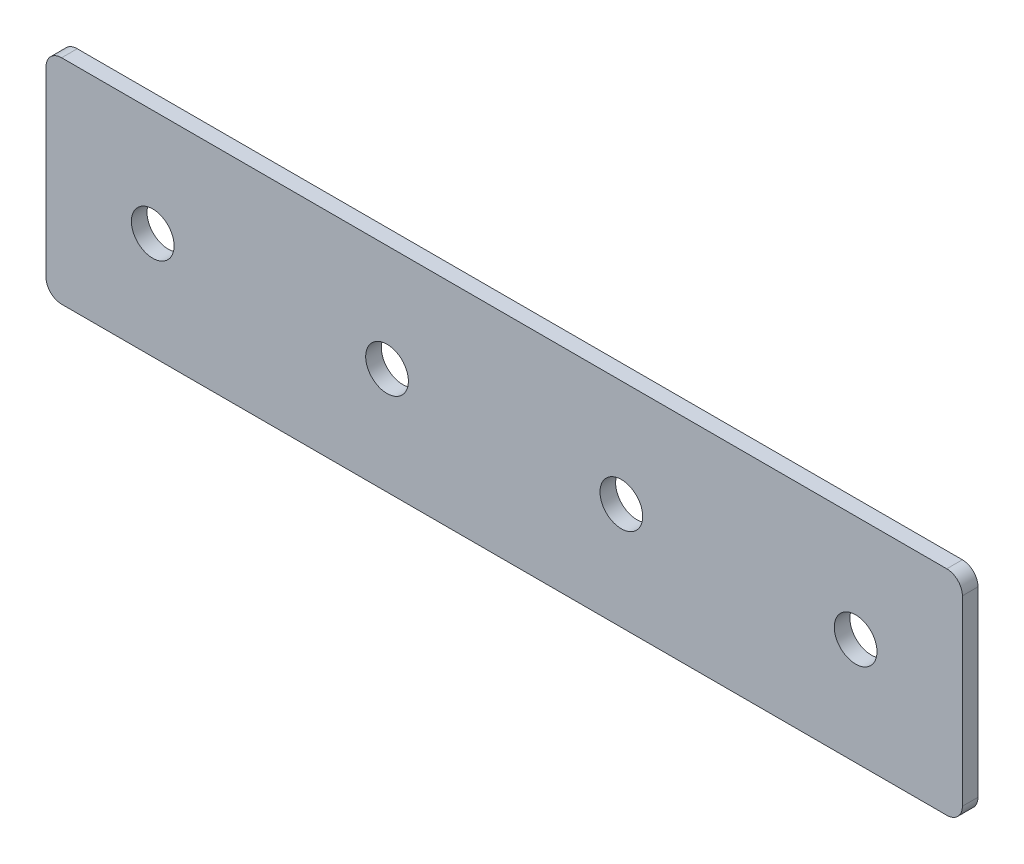
ISO-10303-21;
HEADER;
FILE_DESCRIPTION(('STEP AP214'),'2;1');
FILE_NAME('part.step','',(''),(''),'','','');
FILE_SCHEMA(('AUTOMOTIVE_DESIGN { 1 0 10303 214 1 1 1 1 }'));
ENDSEC;
DATA;
#1=APPLICATION_CONTEXT('core data for automotive mechanical design processes');
#2=APPLICATION_PROTOCOL_DEFINITION('international standard','automotive_design',2000,#1);
#3=PRODUCT_CONTEXT('',#1,'mechanical');
#4=PRODUCT('Part','Part','',(#3));
#5=PRODUCT_RELATED_PRODUCT_CATEGORY('part','',(#4));
#6=PRODUCT_DEFINITION_FORMATION('','',#4);
#7=PRODUCT_DEFINITION_CONTEXT('part definition',#1,'design');
#8=PRODUCT_DEFINITION('design','',#6,#7);
#9=PRODUCT_DEFINITION_SHAPE('','',#8);
#10=(LENGTH_UNIT() NAMED_UNIT(*) SI_UNIT(.MILLI.,.METRE.));
#11=(NAMED_UNIT(*) PLANE_ANGLE_UNIT() SI_UNIT($,.RADIAN.));
#12=(NAMED_UNIT(*) SI_UNIT($,.STERADIAN.) SOLID_ANGLE_UNIT());
#13=UNCERTAINTY_MEASURE_WITH_UNIT(LENGTH_MEASURE(1.E-05),#10,'distance_accuracy_value','');
#14=(GEOMETRIC_REPRESENTATION_CONTEXT(3) GLOBAL_UNCERTAINTY_ASSIGNED_CONTEXT((#13)) GLOBAL_UNIT_ASSIGNED_CONTEXT((#10,
#11,#12)) REPRESENTATION_CONTEXT('',''));
#15=CARTESIAN_POINT('',(0.,0.,0.));
#16=DIRECTION('',(0.,0.,1.));
#17=DIRECTION('',(1.,0.,0.));
#18=AXIS2_PLACEMENT_3D('',#15,#16,#17);
#19=CARTESIAN_POINT('',(0.,0.,3.));
#20=DIRECTION('',(0.,0.,-1.));
#21=DIRECTION('',(-1.,0.,0.));
#22=AXIS2_PLACEMENT_3D('',#19,#20,#21);
#23=PLANE('',#22);
#24=CARTESIAN_POINT('',(135.,0.,3.));
#25=DIRECTION('',(0.,0.,1.));
#26=DIRECTION('',(1.,0.,0.));
#27=AXIS2_PLACEMENT_3D('',#24,#25,#26);
#28=CIRCLE('',#27,4.1);
#29=CARTESIAN_POINT('',(139.1,0.,3.));
#30=VERTEX_POINT('',#29);
#31=EDGE_CURVE('E154',#30,#30,#28,.T.);
#32=ORIENTED_EDGE('',*,*,#31,.F.);
#33=EDGE_LOOP('',(#32));
#34=FACE_BOUND('',#33,.T.);
#35=CARTESIAN_POINT('',(90.,0.,3.));
#36=DIRECTION('',(0.,0.,1.));
#37=DIRECTION('',(1.,0.,0.));
#38=AXIS2_PLACEMENT_3D('',#35,#36,#37);
#39=CIRCLE('',#38,4.1);
#40=CARTESIAN_POINT('',(94.1,0.,3.));
#41=VERTEX_POINT('',#40);
#42=EDGE_CURVE('E160',#41,#41,#39,.T.);
#43=ORIENTED_EDGE('',*,*,#42,.F.);
#44=EDGE_LOOP('',(#43));
#45=FACE_BOUND('',#44,.T.);
#46=CARTESIAN_POINT('',(45.,0.,3.));
#47=DIRECTION('',(0.,0.,1.));
#48=DIRECTION('',(1.,0.,0.));
#49=AXIS2_PLACEMENT_3D('',#46,#47,#48);
#50=CIRCLE('',#49,4.1);
#51=CARTESIAN_POINT('',(49.1,0.,3.));
#52=VERTEX_POINT('',#51);
#53=EDGE_CURVE('E166',#52,#52,#50,.T.);
#54=ORIENTED_EDGE('',*,*,#53,.F.);
#55=EDGE_LOOP('',(#54));
#56=FACE_BOUND('',#55,.T.);
#57=CARTESIAN_POINT('',(0.,0.,3.));
#58=DIRECTION('',(0.,0.,1.));
#59=DIRECTION('',(1.,0.,0.));
#60=AXIS2_PLACEMENT_3D('',#57,#58,#59);
#61=CIRCLE('',#60,4.1);
#62=CARTESIAN_POINT('',(4.1,0.,3.));
#63=VERTEX_POINT('',#62);
#64=EDGE_CURVE('E107',#63,#63,#61,.T.);
#65=ORIENTED_EDGE('',*,*,#64,.F.);
#66=EDGE_LOOP('',(#65));
#67=FACE_BOUND('',#66,.T.);
#68=DIRECTION('',(1.,0.,0.));
#69=VECTOR('',#68,1.);
#70=CARTESIAN_POINT('',(-20.5,-20.5,3.));
#71=LINE('',#70,#69);
#72=CARTESIAN_POINT('',(-17.5,-20.5,3.));
#73=VERTEX_POINT('',#72);
#74=CARTESIAN_POINT('',(152.5,-20.5,3.));
#75=VERTEX_POINT('',#74);
#76=EDGE_CURVE('E84',#73,#75,#71,.T.);
#77=ORIENTED_EDGE('',*,*,#76,.T.);
#78=CARTESIAN_POINT('',(152.5,-17.5,3.));
#79=DIRECTION('',(0.,0.,-1.));
#80=DIRECTION('',(-1.,0.,0.));
#81=AXIS2_PLACEMENT_3D('',#78,#79,#80);
#82=CIRCLE('',#81,3.);
#83=CARTESIAN_POINT('',(155.5,-17.5,3.));
#84=VERTEX_POINT('',#83);
#85=EDGE_CURVE('E91',#75,#84,#82,.F.);
#86=ORIENTED_EDGE('',*,*,#85,.T.);
#87=DIRECTION('',(0.,1.,0.));
#88=VECTOR('',#87,1.);
#89=CARTESIAN_POINT('',(155.5,-20.5,3.));
#90=LINE('',#89,#88);
#91=CARTESIAN_POINT('',(155.5,17.5,3.));
#92=VERTEX_POINT('',#91);
#93=EDGE_CURVE('E102',#84,#92,#90,.T.);
#94=ORIENTED_EDGE('',*,*,#93,.T.);
#95=CARTESIAN_POINT('',(152.5,17.5,3.));
#96=DIRECTION('',(0.,0.,-1.));
#97=DIRECTION('',(-1.,0.,0.));
#98=AXIS2_PLACEMENT_3D('',#95,#96,#97);
#99=CIRCLE('',#98,3.);
#100=CARTESIAN_POINT('',(152.5,20.5,3.));
#101=VERTEX_POINT('',#100);
#102=EDGE_CURVE('E109',#92,#101,#99,.F.);
#103=ORIENTED_EDGE('',*,*,#102,.T.);
#104=DIRECTION('',(-1.,0.,0.));
#105=VECTOR('',#104,1.);
#106=CARTESIAN_POINT('',(155.5,20.5,3.));
#107=LINE('',#106,#105);
#108=CARTESIAN_POINT('',(-17.5,20.5,3.));
#109=VERTEX_POINT('',#108);
#110=EDGE_CURVE('E139',#101,#109,#107,.T.);
#111=ORIENTED_EDGE('',*,*,#110,.T.);
#112=CARTESIAN_POINT('',(-17.5,17.5,3.));
#113=DIRECTION('',(0.,0.,-1.));
#114=DIRECTION('',(-1.,0.,0.));
#115=AXIS2_PLACEMENT_3D('',#112,#113,#114);
#116=CIRCLE('',#115,3.);
#117=CARTESIAN_POINT('',(-20.5,17.5,3.));
#118=VERTEX_POINT('',#117);
#119=EDGE_CURVE('E92',#109,#118,#116,.F.);
#120=ORIENTED_EDGE('',*,*,#119,.T.);
#121=DIRECTION('',(0.,-1.,0.));
#122=VECTOR('',#121,1.);
#123=CARTESIAN_POINT('',(-20.5,20.5,3.));
#124=LINE('',#123,#122);
#125=CARTESIAN_POINT('',(-20.5,-17.5,3.));
#126=VERTEX_POINT('',#125);
#127=EDGE_CURVE('E86',#118,#126,#124,.T.);
#128=ORIENTED_EDGE('',*,*,#127,.T.);
#129=CARTESIAN_POINT('',(-17.5,-17.5,3.));
#130=DIRECTION('',(0.,0.,-1.));
#131=DIRECTION('',(-1.,0.,0.));
#132=AXIS2_PLACEMENT_3D('',#129,#130,#131);
#133=CIRCLE('',#132,3.);
#134=EDGE_CURVE('E82',#126,#73,#133,.F.);
#135=ORIENTED_EDGE('',*,*,#134,.T.);
#136=EDGE_LOOP('',(#77,#86,#94,#103,#111,#120,#128,#135));
#137=FACE_BOUND('',#136,.T.);
#138=ADVANCED_FACE('F16',(#34,#45,#56,#67,#137),#23,.F.);
#139=CARTESIAN_POINT('',(0.,0.,0.));
#140=DIRECTION('',(0.,0.,-1.));
#141=DIRECTION('',(-1.,0.,0.));
#142=AXIS2_PLACEMENT_3D('',#139,#140,#141);
#143=PLANE('',#142);
#144=CARTESIAN_POINT('',(135.,0.,0.));
#145=DIRECTION('',(0.,0.,1.));
#146=DIRECTION('',(1.,0.,0.));
#147=AXIS2_PLACEMENT_3D('',#144,#145,#146);
#148=CIRCLE('',#147,4.1);
#149=CARTESIAN_POINT('',(139.1,0.,0.));
#150=VERTEX_POINT('',#149);
#151=EDGE_CURVE('E150',#150,#150,#148,.T.);
#152=ORIENTED_EDGE('',*,*,#151,.T.);
#153=EDGE_LOOP('',(#152));
#154=FACE_BOUND('',#153,.T.);
#155=CARTESIAN_POINT('',(90.,0.,0.));
#156=DIRECTION('',(0.,0.,1.));
#157=DIRECTION('',(1.,0.,0.));
#158=AXIS2_PLACEMENT_3D('',#155,#156,#157);
#159=CIRCLE('',#158,4.1);
#160=CARTESIAN_POINT('',(94.1,0.,0.));
#161=VERTEX_POINT('',#160);
#162=EDGE_CURVE('E157',#161,#161,#159,.T.);
#163=ORIENTED_EDGE('',*,*,#162,.T.);
#164=EDGE_LOOP('',(#163));
#165=FACE_BOUND('',#164,.T.);
#166=CARTESIAN_POINT('',(45.,0.,0.));
#167=DIRECTION('',(0.,0.,1.));
#168=DIRECTION('',(1.,0.,0.));
#169=AXIS2_PLACEMENT_3D('',#166,#167,#168);
#170=CIRCLE('',#169,4.1);
#171=CARTESIAN_POINT('',(49.1,0.,0.));
#172=VERTEX_POINT('',#171);
#173=EDGE_CURVE('E163',#172,#172,#170,.T.);
#174=ORIENTED_EDGE('',*,*,#173,.T.);
#175=EDGE_LOOP('',(#174));
#176=FACE_BOUND('',#175,.T.);
#177=CARTESIAN_POINT('',(0.,0.,0.));
#178=DIRECTION('',(0.,0.,1.));
#179=DIRECTION('',(1.,0.,0.));
#180=AXIS2_PLACEMENT_3D('',#177,#178,#179);
#181=CIRCLE('',#180,4.1);
#182=CARTESIAN_POINT('',(4.1,0.,0.));
#183=VERTEX_POINT('',#182);
#184=EDGE_CURVE('E112',#183,#183,#181,.T.);
#185=ORIENTED_EDGE('',*,*,#184,.T.);
#186=EDGE_LOOP('',(#185));
#187=FACE_BOUND('',#186,.T.);
#188=DIRECTION('',(0.,1.,0.));
#189=VECTOR('',#188,1.);
#190=CARTESIAN_POINT('',(155.5,-20.5,0.));
#191=LINE('',#190,#189);
#192=CARTESIAN_POINT('',(155.5,-17.5,0.));
#193=VERTEX_POINT('',#192);
#194=CARTESIAN_POINT('',(155.5,17.5,0.));
#195=VERTEX_POINT('',#194);
#196=EDGE_CURVE('E141',#193,#195,#191,.T.);
#197=ORIENTED_EDGE('',*,*,#196,.F.);
#198=CARTESIAN_POINT('',(152.5,-17.5,0.));
#199=DIRECTION('',(0.,0.,-1.));
#200=DIRECTION('',(-1.,0.,0.));
#201=AXIS2_PLACEMENT_3D('',#198,#199,#200);
#202=CIRCLE('',#201,3.);
#203=CARTESIAN_POINT('',(152.5,-20.5,0.));
#204=VERTEX_POINT('',#203);
#205=EDGE_CURVE('E128',#193,#204,#202,.T.);
#206=ORIENTED_EDGE('',*,*,#205,.T.);
#207=DIRECTION('',(1.,0.,0.));
#208=VECTOR('',#207,1.);
#209=CARTESIAN_POINT('',(-20.5,-20.5,0.));
#210=LINE('',#209,#208);
#211=CARTESIAN_POINT('',(-17.5,-20.5,0.));
#212=VERTEX_POINT('',#211);
#213=EDGE_CURVE('E138',#212,#204,#210,.T.);
#214=ORIENTED_EDGE('',*,*,#213,.F.);
#215=CARTESIAN_POINT('',(-17.5,-17.5,0.));
#216=DIRECTION('',(0.,0.,-1.));
#217=DIRECTION('',(-1.,0.,0.));
#218=AXIS2_PLACEMENT_3D('',#215,#216,#217);
#219=CIRCLE('',#218,3.);
#220=CARTESIAN_POINT('',(-20.5,-17.5,0.));
#221=VERTEX_POINT('',#220);
#222=EDGE_CURVE('E106',#212,#221,#219,.T.);
#223=ORIENTED_EDGE('',*,*,#222,.T.);
#224=DIRECTION('',(0.,-1.,0.));
#225=VECTOR('',#224,1.);
#226=CARTESIAN_POINT('',(-20.5,20.5,0.));
#227=LINE('',#226,#225);
#228=CARTESIAN_POINT('',(-20.5,17.5,0.));
#229=VERTEX_POINT('',#228);
#230=EDGE_CURVE('E137',#229,#221,#227,.T.);
#231=ORIENTED_EDGE('',*,*,#230,.F.);
#232=CARTESIAN_POINT('',(-17.5,17.5,0.));
#233=DIRECTION('',(0.,0.,-1.));
#234=DIRECTION('',(-1.,0.,0.));
#235=AXIS2_PLACEMENT_3D('',#232,#233,#234);
#236=CIRCLE('',#235,3.);
#237=CARTESIAN_POINT('',(-17.5,20.5,0.));
#238=VERTEX_POINT('',#237);
#239=EDGE_CURVE('E31',#229,#238,#236,.T.);
#240=ORIENTED_EDGE('',*,*,#239,.T.);
#241=DIRECTION('',(-1.,0.,0.));
#242=VECTOR('',#241,1.);
#243=CARTESIAN_POINT('',(155.5,20.5,0.));
#244=LINE('',#243,#242);
#245=CARTESIAN_POINT('',(152.5,20.5,0.));
#246=VERTEX_POINT('',#245);
#247=EDGE_CURVE('E148',#246,#238,#244,.T.);
#248=ORIENTED_EDGE('',*,*,#247,.F.);
#249=CARTESIAN_POINT('',(152.5,17.5,0.));
#250=DIRECTION('',(0.,0.,-1.));
#251=DIRECTION('',(-1.,0.,0.));
#252=AXIS2_PLACEMENT_3D('',#249,#250,#251);
#253=CIRCLE('',#252,3.);
#254=EDGE_CURVE('E124',#246,#195,#253,.T.);
#255=ORIENTED_EDGE('',*,*,#254,.T.);
#256=EDGE_LOOP('',(#197,#206,#214,#223,#231,#240,#248,#255));
#257=FACE_BOUND('',#256,.T.);
#258=ADVANCED_FACE('F172',(#154,#165,#176,#187,#257),#143,.T.);
#259=CARTESIAN_POINT('',(0.,0.,3.));
#260=DIRECTION('',(0.,0.,-1.));
#261=DIRECTION('',(-1.,0.,0.));
#262=AXIS2_PLACEMENT_3D('',#259,#260,#261);
#263=CYLINDRICAL_SURFACE('',#262,4.1);
#264=ORIENTED_EDGE('',*,*,#64,.T.);
#265=EDGE_LOOP('',(#264));
#266=FACE_BOUND('',#265,.T.);
#267=ORIENTED_EDGE('',*,*,#184,.F.);
#268=EDGE_LOOP('',(#267));
#269=FACE_BOUND('',#268,.T.);
#270=ADVANCED_FACE('F178',(#266,#269),#263,.F.);
#271=CARTESIAN_POINT('',(45.,0.,3.));
#272=DIRECTION('',(0.,0.,-1.));
#273=DIRECTION('',(-1.,0.,0.));
#274=AXIS2_PLACEMENT_3D('',#271,#272,#273);
#275=CYLINDRICAL_SURFACE('',#274,4.1);
#276=ORIENTED_EDGE('',*,*,#53,.T.);
#277=EDGE_LOOP('',(#276));
#278=FACE_BOUND('',#277,.T.);
#279=ORIENTED_EDGE('',*,*,#173,.F.);
#280=EDGE_LOOP('',(#279));
#281=FACE_BOUND('',#280,.T.);
#282=ADVANCED_FACE('F175',(#278,#281),#275,.F.);
#283=CARTESIAN_POINT('',(90.,0.,3.));
#284=DIRECTION('',(0.,0.,-1.));
#285=DIRECTION('',(-1.,0.,0.));
#286=AXIS2_PLACEMENT_3D('',#283,#284,#285);
#287=CYLINDRICAL_SURFACE('',#286,4.1);
#288=ORIENTED_EDGE('',*,*,#42,.T.);
#289=EDGE_LOOP('',(#288));
#290=FACE_BOUND('',#289,.T.);
#291=ORIENTED_EDGE('',*,*,#162,.F.);
#292=EDGE_LOOP('',(#291));
#293=FACE_BOUND('',#292,.T.);
#294=ADVANCED_FACE('F177',(#290,#293),#287,.F.);
#295=CARTESIAN_POINT('',(135.,0.,3.));
#296=DIRECTION('',(0.,0.,-1.));
#297=DIRECTION('',(-1.,0.,0.));
#298=AXIS2_PLACEMENT_3D('',#295,#296,#297);
#299=CYLINDRICAL_SURFACE('',#298,4.1);
#300=ORIENTED_EDGE('',*,*,#31,.T.);
#301=EDGE_LOOP('',(#300));
#302=FACE_BOUND('',#301,.T.);
#303=ORIENTED_EDGE('',*,*,#151,.F.);
#304=EDGE_LOOP('',(#303));
#305=FACE_BOUND('',#304,.T.);
#306=ADVANCED_FACE('F186',(#302,#305),#299,.F.);
#307=CARTESIAN_POINT('',(-20.5,20.5,0.));
#308=DIRECTION('',(-1.,0.,0.));
#309=DIRECTION('',(0.,0.,1.));
#310=AXIS2_PLACEMENT_3D('',#307,#308,#309);
#311=PLANE('',#310);
#312=ORIENTED_EDGE('',*,*,#230,.T.);
#313=DIRECTION('',(0.,0.,1.));
#314=VECTOR('',#313,1.);
#315=CARTESIAN_POINT('',(-20.5,-17.5,0.));
#316=LINE('',#315,#314);
#317=EDGE_CURVE('E132',#221,#126,#316,.T.);
#318=ORIENTED_EDGE('',*,*,#317,.T.);
#319=ORIENTED_EDGE('',*,*,#127,.F.);
#320=DIRECTION('',(0.,0.,1.));
#321=VECTOR('',#320,1.);
#322=CARTESIAN_POINT('',(-20.5,17.5,0.));
#323=LINE('',#322,#321);
#324=EDGE_CURVE('E130',#118,#229,#323,.F.);
#325=ORIENTED_EDGE('',*,*,#324,.T.);
#326=EDGE_LOOP('',(#312,#318,#319,#325));
#327=FACE_BOUND('',#326,.T.);
#328=ADVANCED_FACE('F135',(#327),#311,.T.);
#329=CARTESIAN_POINT('',(155.5,20.5,0.));
#330=DIRECTION('',(0.,1.,0.));
#331=DIRECTION('',(0.,0.,1.));
#332=AXIS2_PLACEMENT_3D('',#329,#330,#331);
#333=PLANE('',#332);
#334=ORIENTED_EDGE('',*,*,#247,.T.);
#335=DIRECTION('',(0.,0.,1.));
#336=VECTOR('',#335,1.);
#337=CARTESIAN_POINT('',(-17.5,20.5,0.));
#338=LINE('',#337,#336);
#339=EDGE_CURVE('E10',#238,#109,#338,.T.);
#340=ORIENTED_EDGE('',*,*,#339,.T.);
#341=ORIENTED_EDGE('',*,*,#110,.F.);
#342=DIRECTION('',(0.,0.,1.));
#343=VECTOR('',#342,1.);
#344=CARTESIAN_POINT('',(152.5,20.5,0.));
#345=LINE('',#344,#343);
#346=EDGE_CURVE('E24',#101,#246,#345,.F.);
#347=ORIENTED_EDGE('',*,*,#346,.T.);
#348=EDGE_LOOP('',(#334,#340,#341,#347));
#349=FACE_BOUND('',#348,.T.);
#350=ADVANCED_FACE('F215',(#349),#333,.T.);
#351=CARTESIAN_POINT('',(155.5,-20.5,0.));
#352=DIRECTION('',(1.,0.,0.));
#353=DIRECTION('',(0.,0.,-1.));
#354=AXIS2_PLACEMENT_3D('',#351,#352,#353);
#355=PLANE('',#354);
#356=ORIENTED_EDGE('',*,*,#93,.F.);
#357=DIRECTION('',(0.,0.,1.));
#358=VECTOR('',#357,1.);
#359=CARTESIAN_POINT('',(155.5,-17.5,0.));
#360=LINE('',#359,#358);
#361=EDGE_CURVE('E122',#84,#193,#360,.F.);
#362=ORIENTED_EDGE('',*,*,#361,.T.);
#363=ORIENTED_EDGE('',*,*,#196,.T.);
#364=DIRECTION('',(0.,0.,1.));
#365=VECTOR('',#364,1.);
#366=CARTESIAN_POINT('',(155.5,17.5,0.));
#367=LINE('',#366,#365);
#368=EDGE_CURVE('E119',#195,#92,#367,.T.);
#369=ORIENTED_EDGE('',*,*,#368,.T.);
#370=EDGE_LOOP('',(#356,#362,#363,#369));
#371=FACE_BOUND('',#370,.T.);
#372=ADVANCED_FACE('F220',(#371),#355,.T.);
#373=CARTESIAN_POINT('',(-20.5,-20.5,0.));
#374=DIRECTION('',(0.,-1.,0.));
#375=DIRECTION('',(0.,0.,-1.));
#376=AXIS2_PLACEMENT_3D('',#373,#374,#375);
#377=PLANE('',#376);
#378=ORIENTED_EDGE('',*,*,#213,.T.);
#379=DIRECTION('',(0.,0.,1.));
#380=VECTOR('',#379,1.);
#381=CARTESIAN_POINT('',(152.5,-20.5,0.));
#382=LINE('',#381,#380);
#383=EDGE_CURVE('E101',#204,#75,#382,.T.);
#384=ORIENTED_EDGE('',*,*,#383,.T.);
#385=ORIENTED_EDGE('',*,*,#76,.F.);
#386=DIRECTION('',(0.,0.,1.));
#387=VECTOR('',#386,1.);
#388=CARTESIAN_POINT('',(-17.5,-20.5,0.));
#389=LINE('',#388,#387);
#390=EDGE_CURVE('E98',#73,#212,#389,.F.);
#391=ORIENTED_EDGE('',*,*,#390,.T.);
#392=EDGE_LOOP('',(#378,#384,#385,#391));
#393=FACE_BOUND('',#392,.T.);
#394=ADVANCED_FACE('F97',(#393),#377,.T.);
#395=CARTESIAN_POINT('',(152.5,-17.5,0.));
#396=DIRECTION('',(0.,0.,1.));
#397=DIRECTION('',(1.,0.,0.));
#398=AXIS2_PLACEMENT_3D('',#395,#396,#397);
#399=CYLINDRICAL_SURFACE('',#398,3.);
#400=ORIENTED_EDGE('',*,*,#205,.F.);
#401=ORIENTED_EDGE('',*,*,#361,.F.);
#402=ORIENTED_EDGE('',*,*,#85,.F.);
#403=ORIENTED_EDGE('',*,*,#383,.F.);
#404=EDGE_LOOP('',(#400,#401,#402,#403));
#405=FACE_BOUND('',#404,.T.);
#406=ADVANCED_FACE('F202',(#405),#399,.T.);
#407=CARTESIAN_POINT('',(-17.5,-17.5,0.));
#408=DIRECTION('',(0.,0.,1.));
#409=DIRECTION('',(1.,0.,0.));
#410=AXIS2_PLACEMENT_3D('',#407,#408,#409);
#411=CYLINDRICAL_SURFACE('',#410,3.);
#412=ORIENTED_EDGE('',*,*,#222,.F.);
#413=ORIENTED_EDGE('',*,*,#390,.F.);
#414=ORIENTED_EDGE('',*,*,#134,.F.);
#415=ORIENTED_EDGE('',*,*,#317,.F.);
#416=EDGE_LOOP('',(#412,#413,#414,#415));
#417=FACE_BOUND('',#416,.T.);
#418=ADVANCED_FACE('F105',(#417),#411,.T.);
#419=CARTESIAN_POINT('',(-17.5,17.5,0.));
#420=DIRECTION('',(0.,0.,1.));
#421=DIRECTION('',(1.,0.,0.));
#422=AXIS2_PLACEMENT_3D('',#419,#420,#421);
#423=CYLINDRICAL_SURFACE('',#422,3.);
#424=ORIENTED_EDGE('',*,*,#239,.F.);
#425=ORIENTED_EDGE('',*,*,#324,.F.);
#426=ORIENTED_EDGE('',*,*,#119,.F.);
#427=ORIENTED_EDGE('',*,*,#339,.F.);
#428=EDGE_LOOP('',(#424,#425,#426,#427));
#429=FACE_BOUND('',#428,.T.);
#430=ADVANCED_FACE('F207',(#429),#423,.T.);
#431=CARTESIAN_POINT('',(152.5,17.5,0.));
#432=DIRECTION('',(0.,0.,1.));
#433=DIRECTION('',(1.,0.,0.));
#434=AXIS2_PLACEMENT_3D('',#431,#432,#433);
#435=CYLINDRICAL_SURFACE('',#434,3.);
#436=ORIENTED_EDGE('',*,*,#254,.F.);
#437=ORIENTED_EDGE('',*,*,#346,.F.);
#438=ORIENTED_EDGE('',*,*,#102,.F.);
#439=ORIENTED_EDGE('',*,*,#368,.F.);
#440=EDGE_LOOP('',(#436,#437,#438,#439));
#441=FACE_BOUND('',#440,.T.);
#442=ADVANCED_FACE('F18',(#441),#435,.T.);
#443=CLOSED_SHELL('',(#138,#258,#270,#282,#294,#306,#328,#350,#372,#394,#406,#418,#430,#442));
#444=MANIFOLD_SOLID_BREP('B1',#443);
#445=ADVANCED_BREP_SHAPE_REPRESENTATION('',(#18,#444),#14);
#446=SHAPE_DEFINITION_REPRESENTATION(#9,#445);
ENDSEC;
END-ISO-10303-21;
